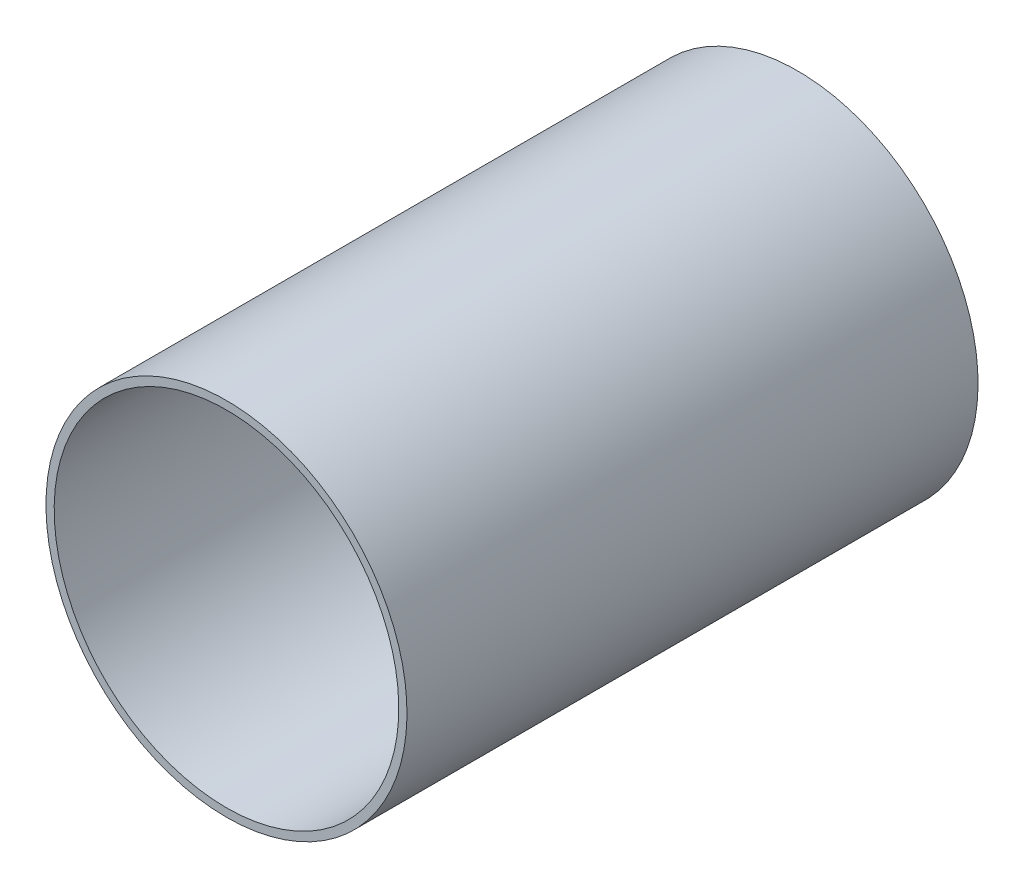
ISO-10303-21;
HEADER;
FILE_DESCRIPTION(('STEP AP214'),'2;1');
FILE_NAME('part.step','',(''),(''),'','','');
FILE_SCHEMA(('AUTOMOTIVE_DESIGN { 1 0 10303 214 1 1 1 1 }'));
ENDSEC;
DATA;
#1=APPLICATION_CONTEXT('core data for automotive mechanical design processes');
#2=APPLICATION_PROTOCOL_DEFINITION('international standard','automotive_design',2000,#1);
#3=PRODUCT_CONTEXT('',#1,'mechanical');
#4=PRODUCT('Part','Part','',(#3));
#5=PRODUCT_RELATED_PRODUCT_CATEGORY('part','',(#4));
#6=PRODUCT_DEFINITION_FORMATION('','',#4);
#7=PRODUCT_DEFINITION_CONTEXT('part definition',#1,'design');
#8=PRODUCT_DEFINITION('design','',#6,#7);
#9=PRODUCT_DEFINITION_SHAPE('','',#8);
#10=(LENGTH_UNIT() NAMED_UNIT(*) SI_UNIT(.MILLI.,.METRE.));
#11=(NAMED_UNIT(*) PLANE_ANGLE_UNIT() SI_UNIT($,.RADIAN.));
#12=(NAMED_UNIT(*) SI_UNIT($,.STERADIAN.) SOLID_ANGLE_UNIT());
#13=UNCERTAINTY_MEASURE_WITH_UNIT(LENGTH_MEASURE(1.E-05),#10,'distance_accuracy_value','');
#14=(GEOMETRIC_REPRESENTATION_CONTEXT(3) GLOBAL_UNCERTAINTY_ASSIGNED_CONTEXT((#13)) GLOBAL_UNIT_ASSIGNED_CONTEXT((#10,
#11,#12)) REPRESENTATION_CONTEXT('',''));
#15=CARTESIAN_POINT('',(0.,0.,0.));
#16=DIRECTION('',(0.,0.,1.));
#17=DIRECTION('',(1.,0.,0.));
#18=AXIS2_PLACEMENT_3D('',#15,#16,#17);
#19=CARTESIAN_POINT('',(134.352,-111.734,-0.045));
#20=DIRECTION('',(0.,0.,-1.));
#21=DIRECTION('',(0.,-1.,0.));
#22=AXIS2_PLACEMENT_3D('',#19,#20,#21);
#23=CYLINDRICAL_SURFACE('',#22,0.525);
#24=CARTESIAN_POINT('',(134.352,-111.734,-0.035));
#25=DIRECTION('',(0.,0.,-1.));
#26=DIRECTION('',(0.,-1.,0.));
#27=AXIS2_PLACEMENT_3D('',#24,#25,#26);
#28=CIRCLE('',#27,0.525);
#29=CARTESIAN_POINT('',(134.352,-112.259,-0.035));
#30=VERTEX_POINT('',#29);
#31=EDGE_CURVE('E64',#30,#30,#28,.T.);
#32=ORIENTED_EDGE('',*,*,#31,.T.);
#33=DIRECTION('',(0.,0.,1.));
#34=VECTOR('',#33,1.);
#35=CARTESIAN_POINT('',(134.352,-112.259,-0.045));
#36=LINE('',#35,#34);
#37=CARTESIAN_POINT('',(134.352,-112.259,1.705));
#38=VERTEX_POINT('',#37);
#39=EDGE_CURVE('E11',#30,#38,#36,.T.);
#40=ORIENTED_EDGE('',*,*,#39,.T.);
#41=CARTESIAN_POINT('',(134.352,-111.734,1.705));
#42=DIRECTION('',(0.,0.,-1.));
#43=DIRECTION('',(0.,-1.,0.));
#44=AXIS2_PLACEMENT_3D('',#41,#42,#43);
#45=CIRCLE('',#44,0.525);
#46=EDGE_CURVE('E25',#38,#38,#45,.T.);
#47=ORIENTED_EDGE('',*,*,#46,.F.);
#48=ORIENTED_EDGE('',*,*,#39,.F.);
#49=EDGE_LOOP('',(#32,#40,#47,#48));
#50=FACE_BOUND('',#49,.T.);
#51=ADVANCED_FACE('F17',(#50),#23,.F.);
#52=CARTESIAN_POINT('',(134.352,-112.284,1.705));
#53=DIRECTION('',(0.,0.,1.));
#54=DIRECTION('',(1.,0.,0.));
#55=AXIS2_PLACEMENT_3D('',#52,#53,#54);
#56=PLANE('',#55);
#57=ORIENTED_EDGE('',*,*,#46,.T.);
#58=EDGE_LOOP('',(#57));
#59=FACE_BOUND('',#58,.T.);
#60=CARTESIAN_POINT('',(134.352,-111.734,1.705));
#61=DIRECTION('',(0.,0.,1.));
#62=DIRECTION('',(0.,-1.,0.));
#63=AXIS2_PLACEMENT_3D('',#60,#61,#62);
#64=CIRCLE('',#63,0.55);
#65=CARTESIAN_POINT('',(134.352,-112.284,1.705));
#66=VERTEX_POINT('',#65);
#67=EDGE_CURVE('E56',#66,#66,#64,.T.);
#68=ORIENTED_EDGE('',*,*,#67,.T.);
#69=EDGE_LOOP('',(#68));
#70=FACE_BOUND('',#69,.T.);
#71=ADVANCED_FACE('F73',(#59,#70),#56,.T.);
#72=CARTESIAN_POINT('',(134.352,-112.284,-0.035));
#73=DIRECTION('',(0.,0.,1.));
#74=DIRECTION('',(1.,0.,0.));
#75=AXIS2_PLACEMENT_3D('',#72,#73,#74);
#76=PLANE('',#75);
#77=ORIENTED_EDGE('',*,*,#31,.F.);
#78=EDGE_LOOP('',(#77));
#79=FACE_BOUND('',#78,.T.);
#80=CARTESIAN_POINT('',(134.352,-111.734,-0.035));
#81=DIRECTION('',(0.,0.,1.));
#82=DIRECTION('',(0.,-1.,0.));
#83=AXIS2_PLACEMENT_3D('',#80,#81,#82);
#84=CIRCLE('',#83,0.55);
#85=CARTESIAN_POINT('',(134.352,-112.284,-0.035));
#86=VERTEX_POINT('',#85);
#87=EDGE_CURVE('E55',#86,#86,#84,.T.);
#88=ORIENTED_EDGE('',*,*,#87,.F.);
#89=EDGE_LOOP('',(#88));
#90=FACE_BOUND('',#89,.T.);
#91=ADVANCED_FACE('F82',(#79,#90),#76,.F.);
#92=CARTESIAN_POINT('',(134.352,-111.734,-0.035));
#93=DIRECTION('',(0.,0.,-1.));
#94=DIRECTION('',(0.,-1.,0.));
#95=AXIS2_PLACEMENT_3D('',#92,#93,#94);
#96=CYLINDRICAL_SURFACE('',#95,0.55);
#97=ORIENTED_EDGE('',*,*,#87,.T.);
#98=DIRECTION('',(0.,0.,1.));
#99=VECTOR('',#98,1.);
#100=CARTESIAN_POINT('',(134.352,-112.284,-0.035));
#101=LINE('',#100,#99);
#102=EDGE_CURVE('E52',#86,#66,#101,.T.);
#103=ORIENTED_EDGE('',*,*,#102,.T.);
#104=ORIENTED_EDGE('',*,*,#67,.F.);
#105=ORIENTED_EDGE('',*,*,#102,.F.);
#106=EDGE_LOOP('',(#97,#103,#104,#105));
#107=FACE_BOUND('',#106,.T.);
#108=ADVANCED_FACE('F53',(#107),#96,.T.);
#109=CLOSED_SHELL('',(#51,#71,#91,#108));
#110=MANIFOLD_SOLID_BREP('B1',#109);
#111=ADVANCED_BREP_SHAPE_REPRESENTATION('',(#18,#110),#14);
#112=SHAPE_DEFINITION_REPRESENTATION(#9,#111);
ENDSEC;
END-ISO-10303-21;
